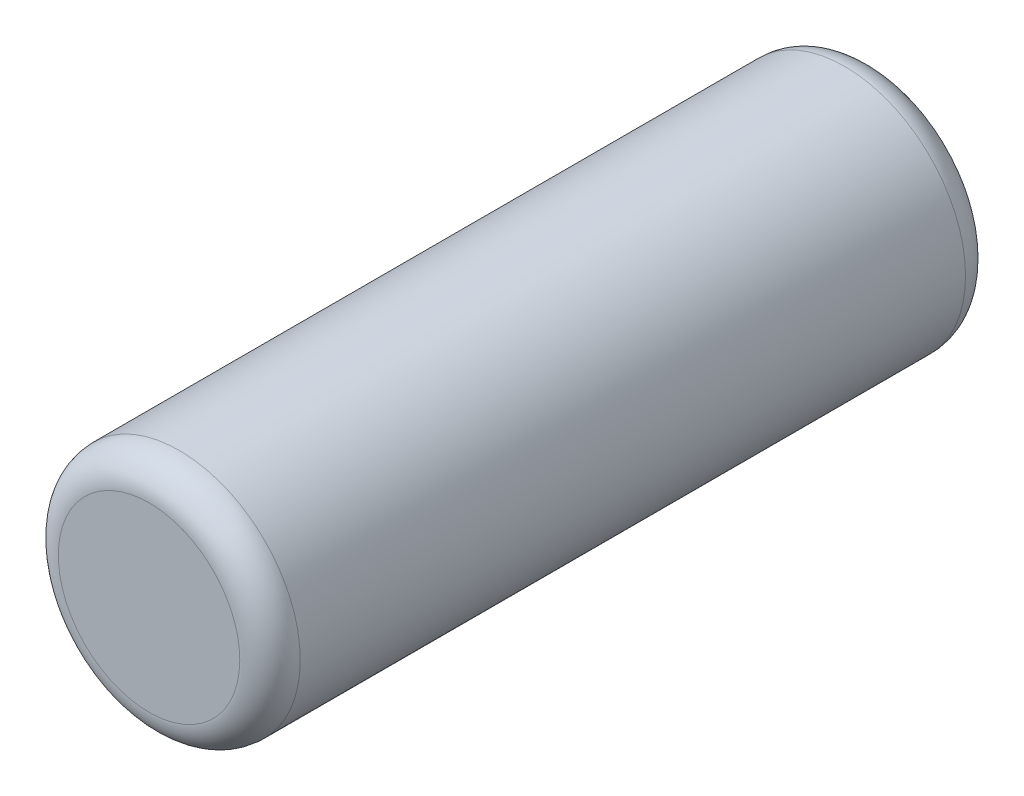
ISO-10303-21;
HEADER;
FILE_DESCRIPTION(('STEP AP214'),'2;1');
FILE_NAME('part.step','',(''),(''),'','','');
FILE_SCHEMA(('AUTOMOTIVE_DESIGN { 1 0 10303 214 1 1 1 1 }'));
ENDSEC;
DATA;
#1=APPLICATION_CONTEXT('core data for automotive mechanical design processes');
#2=APPLICATION_PROTOCOL_DEFINITION('international standard','automotive_design',2000,#1);
#3=PRODUCT_CONTEXT('',#1,'mechanical');
#4=PRODUCT('Part','Part','',(#3));
#5=PRODUCT_RELATED_PRODUCT_CATEGORY('part','',(#4));
#6=PRODUCT_DEFINITION_FORMATION('','',#4);
#7=PRODUCT_DEFINITION_CONTEXT('part definition',#1,'design');
#8=PRODUCT_DEFINITION('design','',#6,#7);
#9=PRODUCT_DEFINITION_SHAPE('','',#8);
#10=(LENGTH_UNIT() NAMED_UNIT(*) SI_UNIT(.MILLI.,.METRE.));
#11=(NAMED_UNIT(*) PLANE_ANGLE_UNIT() SI_UNIT($,.RADIAN.));
#12=(NAMED_UNIT(*) SI_UNIT($,.STERADIAN.) SOLID_ANGLE_UNIT());
#13=UNCERTAINTY_MEASURE_WITH_UNIT(LENGTH_MEASURE(1.E-05),#10,'distance_accuracy_value','');
#14=(GEOMETRIC_REPRESENTATION_CONTEXT(3) GLOBAL_UNCERTAINTY_ASSIGNED_CONTEXT((#13)) GLOBAL_UNIT_ASSIGNED_CONTEXT((#10,
#11,#12)) REPRESENTATION_CONTEXT('',''));
#15=CARTESIAN_POINT('',(0.,0.,0.));
#16=DIRECTION('',(0.,0.,1.));
#17=DIRECTION('',(1.,0.,0.));
#18=AXIS2_PLACEMENT_3D('',#15,#16,#17);
#19=CARTESIAN_POINT('',(90.,0.,24.));
#20=DIRECTION('',(0.,0.,-1.));
#21=DIRECTION('',(-1.,0.,0.));
#22=AXIS2_PLACEMENT_3D('',#19,#20,#21);
#23=CYLINDRICAL_SURFACE('',#22,4.00000000000002);
#24=CARTESIAN_POINT('',(90.,0.,23.));
#25=DIRECTION('',(0.,0.,1.));
#26=DIRECTION('',(1.,0.,0.));
#27=AXIS2_PLACEMENT_3D('',#24,#25,#26);
#28=CIRCLE('',#27,4.00000000000002);
#29=CARTESIAN_POINT('',(94.,0.,23.));
#30=VERTEX_POINT('',#29);
#31=EDGE_CURVE('E58',#30,#30,#28,.F.);
#32=ORIENTED_EDGE('',*,*,#31,.T.);
#33=EDGE_LOOP('',(#32));
#34=FACE_BOUND('',#33,.T.);
#35=CARTESIAN_POINT('',(90.,0.,1.));
#36=DIRECTION('',(0.,0.,1.));
#37=DIRECTION('',(1.,0.,0.));
#38=AXIS2_PLACEMENT_3D('',#35,#36,#37);
#39=CIRCLE('',#38,4.00000000000002);
#40=CARTESIAN_POINT('',(94.,0.,1.));
#41=VERTEX_POINT('',#40);
#42=EDGE_CURVE('E63',#41,#41,#39,.T.);
#43=ORIENTED_EDGE('',*,*,#42,.T.);
#44=EDGE_LOOP('',(#43));
#45=FACE_BOUND('',#44,.T.);
#46=ADVANCED_FACE('F45',(#34,#45),#23,.T.);
#47=CARTESIAN_POINT('',(0.,0.,24.));
#48=DIRECTION('',(0.,0.,1.));
#49=DIRECTION('',(1.,0.,0.));
#50=AXIS2_PLACEMENT_3D('',#47,#48,#49);
#51=PLANE('',#50);
#52=CARTESIAN_POINT('',(90.,0.,24.));
#53=DIRECTION('',(0.,0.,1.));
#54=DIRECTION('',(1.,0.,0.));
#55=AXIS2_PLACEMENT_3D('',#52,#53,#54);
#56=CIRCLE('',#55,3.00000000000002);
#57=CARTESIAN_POINT('',(93.,0.,24.));
#58=VERTEX_POINT('',#57);
#59=EDGE_CURVE('E53',#58,#58,#56,.T.);
#60=ORIENTED_EDGE('',*,*,#59,.T.);
#61=EDGE_LOOP('',(#60));
#62=FACE_BOUND('',#61,.T.);
#63=ADVANCED_FACE('F80',(#62),#51,.T.);
#64=CARTESIAN_POINT('',(0.,0.,0.));
#65=DIRECTION('',(0.,0.,1.));
#66=DIRECTION('',(1.,0.,0.));
#67=AXIS2_PLACEMENT_3D('',#64,#65,#66);
#68=PLANE('',#67);
#69=CARTESIAN_POINT('',(90.,0.,0.));
#70=DIRECTION('',(0.,0.,1.));
#71=DIRECTION('',(1.,0.,0.));
#72=AXIS2_PLACEMENT_3D('',#69,#70,#71);
#73=CIRCLE('',#72,3.00000000000002);
#74=CARTESIAN_POINT('',(93.,0.,0.));
#75=VERTEX_POINT('',#74);
#76=EDGE_CURVE('E10',#75,#75,#73,.F.);
#77=ORIENTED_EDGE('',*,*,#76,.T.);
#78=EDGE_LOOP('',(#77));
#79=FACE_BOUND('',#78,.T.);
#80=ADVANCED_FACE('F77',(#79),#68,.F.);
#81=CARTESIAN_POINT('',(90.,0.,23.));
#82=DIRECTION('',(0.,0.,1.));
#83=DIRECTION('',(1.,0.,0.));
#84=AXIS2_PLACEMENT_3D('',#81,#82,#83);
#85=TOROIDAL_SURFACE('',#84,3.00000000000002,1.);
#86=ORIENTED_EDGE('',*,*,#59,.F.);
#87=EDGE_LOOP('',(#86));
#88=FACE_BOUND('',#87,.T.);
#89=ORIENTED_EDGE('',*,*,#31,.F.);
#90=EDGE_LOOP('',(#89));
#91=FACE_BOUND('',#90,.T.);
#92=ADVANCED_FACE('F73',(#88,#91),#85,.T.);
#93=CARTESIAN_POINT('',(90.,0.,1.));
#94=DIRECTION('',(0.,0.,1.));
#95=DIRECTION('',(1.,0.,0.));
#96=AXIS2_PLACEMENT_3D('',#93,#94,#95);
#97=TOROIDAL_SURFACE('',#96,3.00000000000002,1.);
#98=ORIENTED_EDGE('',*,*,#42,.F.);
#99=EDGE_LOOP('',(#98));
#100=FACE_BOUND('',#99,.T.);
#101=ORIENTED_EDGE('',*,*,#76,.F.);
#102=EDGE_LOOP('',(#101));
#103=FACE_BOUND('',#102,.T.);
#104=ADVANCED_FACE('F47',(#100,#103),#97,.T.);
#105=CLOSED_SHELL('',(#46,#63,#80,#92,#104));
#106=MANIFOLD_SOLID_BREP('B2',#105);
#107=ADVANCED_BREP_SHAPE_REPRESENTATION('',(#18,#106),#14);
#108=SHAPE_DEFINITION_REPRESENTATION(#9,#107);
ENDSEC;
END-ISO-10303-21;
